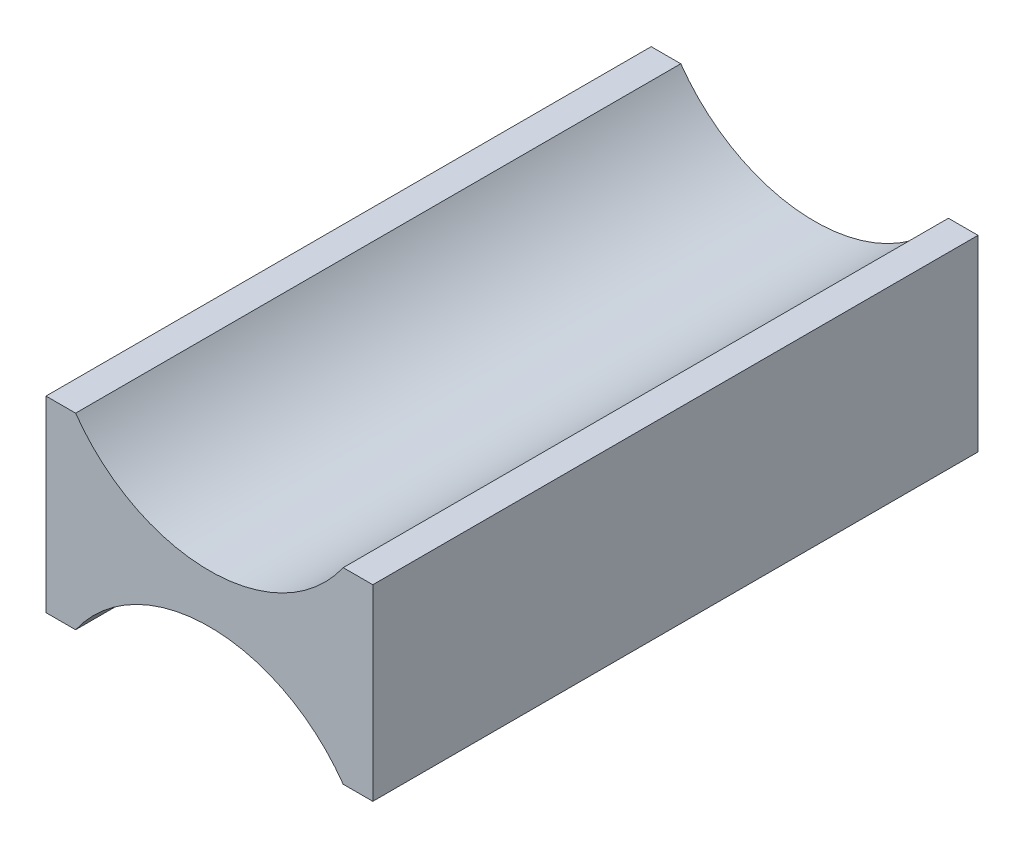
ISO-10303-21;
HEADER;
FILE_DESCRIPTION(('STEP AP214'),'2;1');
FILE_NAME('part.step','',(''),(''),'','','');
FILE_SCHEMA(('AUTOMOTIVE_DESIGN { 1 0 10303 214 1 1 1 1 }'));
ENDSEC;
DATA;
#1=APPLICATION_CONTEXT('core data for automotive mechanical design processes');
#2=APPLICATION_PROTOCOL_DEFINITION('international standard','automotive_design',2000,#1);
#3=PRODUCT_CONTEXT('',#1,'mechanical');
#4=PRODUCT('Part','Part','',(#3));
#5=PRODUCT_RELATED_PRODUCT_CATEGORY('part','',(#4));
#6=PRODUCT_DEFINITION_FORMATION('','',#4);
#7=PRODUCT_DEFINITION_CONTEXT('part definition',#1,'design');
#8=PRODUCT_DEFINITION('design','',#6,#7);
#9=PRODUCT_DEFINITION_SHAPE('','',#8);
#10=(LENGTH_UNIT() NAMED_UNIT(*) SI_UNIT(.MILLI.,.METRE.));
#11=(NAMED_UNIT(*) PLANE_ANGLE_UNIT() SI_UNIT($,.RADIAN.));
#12=(NAMED_UNIT(*) SI_UNIT($,.STERADIAN.) SOLID_ANGLE_UNIT());
#13=UNCERTAINTY_MEASURE_WITH_UNIT(LENGTH_MEASURE(1.E-05),#10,'distance_accuracy_value','');
#14=(GEOMETRIC_REPRESENTATION_CONTEXT(3) GLOBAL_UNCERTAINTY_ASSIGNED_CONTEXT((#13)) GLOBAL_UNIT_ASSIGNED_CONTEXT((#10,
#11,#12)) REPRESENTATION_CONTEXT('',''));
#15=CARTESIAN_POINT('',(0.,0.,0.));
#16=DIRECTION('',(0.,0.,1.));
#17=DIRECTION('',(1.,0.,0.));
#18=AXIS2_PLACEMENT_3D('',#15,#16,#17);
#19=CARTESIAN_POINT('',(0.,-3.1,10.));
#20=DIRECTION('',(0.,0.,-1.));
#21=DIRECTION('',(-1.,0.,0.));
#22=AXIS2_PLACEMENT_3D('',#19,#20,#21);
#23=CYLINDRICAL_SURFACE('',#22,2.7);
#24=CARTESIAN_POINT('',(0.,-3.1,0.));
#25=DIRECTION('',(0.,0.,1.));
#26=DIRECTION('',(1.,0.,0.));
#27=AXIS2_PLACEMENT_3D('',#24,#25,#26);
#28=CIRCLE('',#27,2.7);
#29=CARTESIAN_POINT('',(2.21076909694341,-1.55,0.));
#30=VERTEX_POINT('',#29);
#31=CARTESIAN_POINT('',(-2.21076909694341,-1.55,0.));
#32=VERTEX_POINT('',#31);
#33=EDGE_CURVE('E135',#30,#32,#28,.T.);
#34=ORIENTED_EDGE('',*,*,#33,.F.);
#35=DIRECTION('',(0.,0.,-1.));
#36=VECTOR('',#35,1.);
#37=CARTESIAN_POINT('',(2.21076909694341,-1.55,10.));
#38=LINE('',#37,#36);
#39=CARTESIAN_POINT('',(2.21076909694341,-1.55,10.));
#40=VERTEX_POINT('',#39);
#41=EDGE_CURVE('E11',#40,#30,#38,.T.);
#42=ORIENTED_EDGE('',*,*,#41,.F.);
#43=CARTESIAN_POINT('',(0.,-3.1,10.));
#44=DIRECTION('',(0.,0.,1.));
#45=DIRECTION('',(1.,0.,0.));
#46=AXIS2_PLACEMENT_3D('',#43,#44,#45);
#47=CIRCLE('',#46,2.7);
#48=CARTESIAN_POINT('',(-2.21076909694341,-1.55,10.));
#49=VERTEX_POINT('',#48);
#50=EDGE_CURVE('E177',#40,#49,#47,.T.);
#51=ORIENTED_EDGE('',*,*,#50,.T.);
#52=DIRECTION('',(0.,0.,-1.));
#53=VECTOR('',#52,1.);
#54=CARTESIAN_POINT('',(-2.21076909694341,-1.55,10.));
#55=LINE('',#54,#53);
#56=EDGE_CURVE('E89',#49,#32,#55,.T.);
#57=ORIENTED_EDGE('',*,*,#56,.T.);
#58=EDGE_LOOP('',(#34,#42,#51,#57));
#59=FACE_BOUND('',#58,.T.);
#60=ADVANCED_FACE('F39',(#59),#23,.F.);
#61=CARTESIAN_POINT('',(0.,-1.55,10.));
#62=DIRECTION('',(0.,1.,0.));
#63=DIRECTION('',(0.,0.,1.));
#64=AXIS2_PLACEMENT_3D('',#61,#62,#63);
#65=PLANE('',#64);
#66=DIRECTION('',(1.,0.,0.));
#67=VECTOR('',#66,1.);
#68=CARTESIAN_POINT('',(0.,-1.55,0.));
#69=LINE('',#68,#67);
#70=CARTESIAN_POINT('',(2.7,-1.55,0.));
#71=VERTEX_POINT('',#70);
#72=EDGE_CURVE('E138',#30,#71,#69,.T.);
#73=ORIENTED_EDGE('',*,*,#72,.T.);
#74=DIRECTION('',(0.,0.,-1.));
#75=VECTOR('',#74,1.);
#76=CARTESIAN_POINT('',(2.7,-1.55,10.));
#77=LINE('',#76,#75);
#78=CARTESIAN_POINT('',(2.7,-1.55,10.));
#79=VERTEX_POINT('',#78);
#80=EDGE_CURVE('E47',#79,#71,#77,.T.);
#81=ORIENTED_EDGE('',*,*,#80,.F.);
#82=DIRECTION('',(1.,0.,0.));
#83=VECTOR('',#82,1.);
#84=CARTESIAN_POINT('',(0.,-1.55,10.));
#85=LINE('',#84,#83);
#86=EDGE_CURVE('E132',#40,#79,#85,.T.);
#87=ORIENTED_EDGE('',*,*,#86,.F.);
#88=ORIENTED_EDGE('',*,*,#41,.T.);
#89=EDGE_LOOP('',(#73,#81,#87,#88));
#90=FACE_BOUND('',#89,.T.);
#91=ADVANCED_FACE('F180',(#90),#65,.F.);
#92=CARTESIAN_POINT('',(2.7,0.,10.));
#93=DIRECTION('',(-1.,0.,0.));
#94=DIRECTION('',(0.,0.,1.));
#95=AXIS2_PLACEMENT_3D('',#92,#93,#94);
#96=PLANE('',#95);
#97=DIRECTION('',(0.,1.,0.));
#98=VECTOR('',#97,1.);
#99=CARTESIAN_POINT('',(2.7,0.,0.));
#100=LINE('',#99,#98);
#101=CARTESIAN_POINT('',(2.7,1.55,0.));
#102=VERTEX_POINT('',#101);
#103=EDGE_CURVE('E140',#71,#102,#100,.T.);
#104=ORIENTED_EDGE('',*,*,#103,.T.);
#105=DIRECTION('',(0.,0.,-1.));
#106=VECTOR('',#105,1.);
#107=CARTESIAN_POINT('',(2.7,1.55,10.));
#108=LINE('',#107,#106);
#109=CARTESIAN_POINT('',(2.7,1.55,10.));
#110=VERTEX_POINT('',#109);
#111=EDGE_CURVE('E157',#110,#102,#108,.T.);
#112=ORIENTED_EDGE('',*,*,#111,.F.);
#113=DIRECTION('',(0.,1.,0.));
#114=VECTOR('',#113,1.);
#115=CARTESIAN_POINT('',(2.7,0.,10.));
#116=LINE('',#115,#114);
#117=EDGE_CURVE('E165',#79,#110,#116,.T.);
#118=ORIENTED_EDGE('',*,*,#117,.F.);
#119=ORIENTED_EDGE('',*,*,#80,.T.);
#120=EDGE_LOOP('',(#104,#112,#118,#119));
#121=FACE_BOUND('',#120,.T.);
#122=ADVANCED_FACE('F163',(#121),#96,.F.);
#123=CARTESIAN_POINT('',(0.,1.55,10.));
#124=DIRECTION('',(0.,1.,0.));
#125=DIRECTION('',(0.,0.,1.));
#126=AXIS2_PLACEMENT_3D('',#123,#124,#125);
#127=PLANE('',#126);
#128=DIRECTION('',(1.,0.,0.));
#129=VECTOR('',#128,1.);
#130=CARTESIAN_POINT('',(0.,1.55,0.));
#131=LINE('',#130,#129);
#132=CARTESIAN_POINT('',(2.21076909694341,1.55,0.));
#133=VERTEX_POINT('',#132);
#134=EDGE_CURVE('E144',#133,#102,#131,.T.);
#135=ORIENTED_EDGE('',*,*,#134,.F.);
#136=DIRECTION('',(0.,0.,-1.));
#137=VECTOR('',#136,1.);
#138=CARTESIAN_POINT('',(2.21076909694341,1.55,10.));
#139=LINE('',#138,#137);
#140=CARTESIAN_POINT('',(2.21076909694341,1.55,10.));
#141=VERTEX_POINT('',#140);
#142=EDGE_CURVE('E155',#141,#133,#139,.T.);
#143=ORIENTED_EDGE('',*,*,#142,.F.);
#144=DIRECTION('',(1.,0.,0.));
#145=VECTOR('',#144,1.);
#146=CARTESIAN_POINT('',(0.,1.55,10.));
#147=LINE('',#146,#145);
#148=EDGE_CURVE('E128',#141,#110,#147,.T.);
#149=ORIENTED_EDGE('',*,*,#148,.T.);
#150=ORIENTED_EDGE('',*,*,#111,.T.);
#151=EDGE_LOOP('',(#135,#143,#149,#150));
#152=FACE_BOUND('',#151,.T.);
#153=ADVANCED_FACE('F173',(#152),#127,.T.);
#154=CARTESIAN_POINT('',(0.,3.1,10.));
#155=DIRECTION('',(0.,0.,-1.));
#156=DIRECTION('',(-1.,0.,0.));
#157=AXIS2_PLACEMENT_3D('',#154,#155,#156);
#158=CYLINDRICAL_SURFACE('',#157,2.7);
#159=CARTESIAN_POINT('',(0.,3.1,0.));
#160=DIRECTION('',(0.,0.,1.));
#161=DIRECTION('',(1.,0.,0.));
#162=AXIS2_PLACEMENT_3D('',#159,#160,#161);
#163=CIRCLE('',#162,2.7);
#164=CARTESIAN_POINT('',(-2.21076909694341,1.55,0.));
#165=VERTEX_POINT('',#164);
#166=EDGE_CURVE('E147',#165,#133,#163,.T.);
#167=ORIENTED_EDGE('',*,*,#166,.F.);
#168=DIRECTION('',(0.,0.,-1.));
#169=VECTOR('',#168,1.);
#170=CARTESIAN_POINT('',(-2.21076909694341,1.55,10.));
#171=LINE('',#170,#169);
#172=CARTESIAN_POINT('',(-2.21076909694341,1.55,10.));
#173=VERTEX_POINT('',#172);
#174=EDGE_CURVE('E119',#173,#165,#171,.T.);
#175=ORIENTED_EDGE('',*,*,#174,.F.);
#176=CARTESIAN_POINT('',(0.,3.1,10.));
#177=DIRECTION('',(0.,0.,1.));
#178=DIRECTION('',(1.,0.,0.));
#179=AXIS2_PLACEMENT_3D('',#176,#177,#178);
#180=CIRCLE('',#179,2.7);
#181=EDGE_CURVE('E126',#173,#141,#180,.T.);
#182=ORIENTED_EDGE('',*,*,#181,.T.);
#183=ORIENTED_EDGE('',*,*,#142,.T.);
#184=EDGE_LOOP('',(#167,#175,#182,#183));
#185=FACE_BOUND('',#184,.T.);
#186=ADVANCED_FACE('F199',(#185),#158,.F.);
#187=CARTESIAN_POINT('',(-2.7,1.55,0.));
#188=VERTEX_POINT('',#187);
#189=EDGE_CURVE('E114',#188,#165,#131,.T.);
#190=ORIENTED_EDGE('',*,*,#189,.F.);
#191=DIRECTION('',(0.,0.,-1.));
#192=VECTOR('',#191,1.);
#193=CARTESIAN_POINT('',(-2.7,1.55,10.));
#194=LINE('',#193,#192);
#195=CARTESIAN_POINT('',(-2.7,1.55,10.));
#196=VERTEX_POINT('',#195);
#197=EDGE_CURVE('E109',#196,#188,#194,.T.);
#198=ORIENTED_EDGE('',*,*,#197,.F.);
#199=EDGE_CURVE('E112',#196,#173,#147,.T.);
#200=ORIENTED_EDGE('',*,*,#199,.T.);
#201=ORIENTED_EDGE('',*,*,#174,.T.);
#202=EDGE_LOOP('',(#190,#198,#200,#201));
#203=FACE_BOUND('',#202,.T.);
#204=ADVANCED_FACE('F111',(#203),#127,.T.);
#205=CARTESIAN_POINT('',(-2.7,0.,10.));
#206=DIRECTION('',(-1.,0.,0.));
#207=DIRECTION('',(0.,0.,1.));
#208=AXIS2_PLACEMENT_3D('',#205,#206,#207);
#209=PLANE('',#208);
#210=DIRECTION('',(0.,1.,0.));
#211=VECTOR('',#210,1.);
#212=CARTESIAN_POINT('',(-2.7,0.,0.));
#213=LINE('',#212,#211);
#214=CARTESIAN_POINT('',(-2.7,-1.55,0.));
#215=VERTEX_POINT('',#214);
#216=EDGE_CURVE('E150',#215,#188,#213,.T.);
#217=ORIENTED_EDGE('',*,*,#216,.F.);
#218=DIRECTION('',(0.,0.,-1.));
#219=VECTOR('',#218,1.);
#220=CARTESIAN_POINT('',(-2.7,-1.55,10.));
#221=LINE('',#220,#219);
#222=CARTESIAN_POINT('',(-2.7,-1.55,10.));
#223=VERTEX_POINT('',#222);
#224=EDGE_CURVE('E82',#223,#215,#221,.T.);
#225=ORIENTED_EDGE('',*,*,#224,.F.);
#226=DIRECTION('',(0.,1.,0.));
#227=VECTOR('',#226,1.);
#228=CARTESIAN_POINT('',(-2.7,0.,10.));
#229=LINE('',#228,#227);
#230=EDGE_CURVE('E123',#223,#196,#229,.T.);
#231=ORIENTED_EDGE('',*,*,#230,.T.);
#232=ORIENTED_EDGE('',*,*,#197,.T.);
#233=EDGE_LOOP('',(#217,#225,#231,#232));
#234=FACE_BOUND('',#233,.T.);
#235=ADVANCED_FACE('F129',(#234),#209,.T.);
#236=EDGE_CURVE('E141',#215,#32,#69,.T.);
#237=ORIENTED_EDGE('',*,*,#236,.T.);
#238=ORIENTED_EDGE('',*,*,#56,.F.);
#239=EDGE_CURVE('E55',#223,#49,#85,.T.);
#240=ORIENTED_EDGE('',*,*,#239,.F.);
#241=ORIENTED_EDGE('',*,*,#224,.T.);
#242=EDGE_LOOP('',(#237,#238,#240,#241));
#243=FACE_BOUND('',#242,.T.);
#244=ADVANCED_FACE('F178',(#243),#65,.F.);
#245=CARTESIAN_POINT('',(0.,0.,10.));
#246=DIRECTION('',(0.,0.,1.));
#247=DIRECTION('',(1.,0.,0.));
#248=AXIS2_PLACEMENT_3D('',#245,#246,#247);
#249=PLANE('',#248);
#250=ORIENTED_EDGE('',*,*,#50,.F.);
#251=ORIENTED_EDGE('',*,*,#86,.T.);
#252=ORIENTED_EDGE('',*,*,#117,.T.);
#253=ORIENTED_EDGE('',*,*,#148,.F.);
#254=ORIENTED_EDGE('',*,*,#181,.F.);
#255=ORIENTED_EDGE('',*,*,#199,.F.);
#256=ORIENTED_EDGE('',*,*,#230,.F.);
#257=ORIENTED_EDGE('',*,*,#239,.T.);
#258=EDGE_LOOP('',(#250,#251,#252,#253,#254,#255,#256,#257));
#259=FACE_BOUND('',#258,.T.);
#260=ADVANCED_FACE('F122',(#259),#249,.T.);
#261=CARTESIAN_POINT('',(0.,0.,0.));
#262=DIRECTION('',(0.,0.,1.));
#263=DIRECTION('',(1.,0.,0.));
#264=AXIS2_PLACEMENT_3D('',#261,#262,#263);
#265=PLANE('',#264);
#266=ORIENTED_EDGE('',*,*,#33,.T.);
#267=ORIENTED_EDGE('',*,*,#236,.F.);
#268=ORIENTED_EDGE('',*,*,#216,.T.);
#269=ORIENTED_EDGE('',*,*,#189,.T.);
#270=ORIENTED_EDGE('',*,*,#166,.T.);
#271=ORIENTED_EDGE('',*,*,#134,.T.);
#272=ORIENTED_EDGE('',*,*,#103,.F.);
#273=ORIENTED_EDGE('',*,*,#72,.F.);
#274=EDGE_LOOP('',(#266,#267,#268,#269,#270,#271,#272,#273));
#275=FACE_BOUND('',#274,.T.);
#276=ADVANCED_FACE('F169',(#275),#265,.F.);
#277=CLOSED_SHELL('',(#60,#91,#122,#153,#186,#204,#235,#244,#260,#276));
#278=MANIFOLD_SOLID_BREP('B2',#277);
#279=ADVANCED_BREP_SHAPE_REPRESENTATION('',(#18,#278),#14);
#280=SHAPE_DEFINITION_REPRESENTATION(#9,#279);
ENDSEC;
END-ISO-10303-21;
